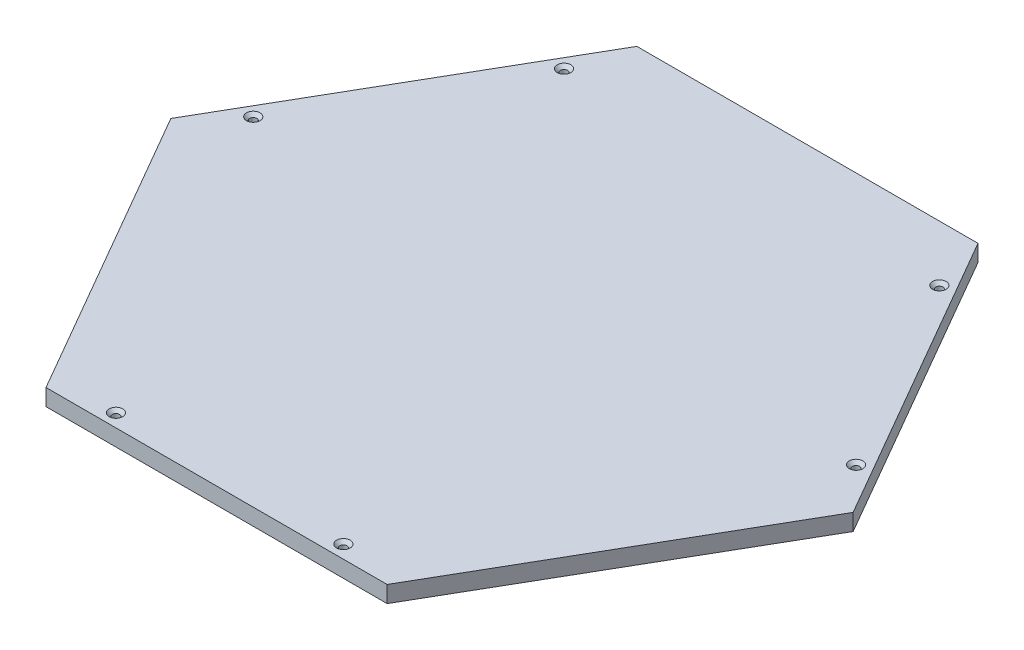
ISO-10303-21;
HEADER;
FILE_DESCRIPTION(('STEP AP214'),'2;1');
FILE_NAME('part.step','',(''),(''),'','','');
FILE_SCHEMA(('AUTOMOTIVE_DESIGN { 1 0 10303 214 1 1 1 1 }'));
ENDSEC;
DATA;
#1=APPLICATION_CONTEXT('core data for automotive mechanical design processes');
#2=APPLICATION_PROTOCOL_DEFINITION('international standard','automotive_design',2000,#1);
#3=PRODUCT_CONTEXT('',#1,'mechanical');
#4=PRODUCT('Part','Part','',(#3));
#5=PRODUCT_RELATED_PRODUCT_CATEGORY('part','',(#4));
#6=PRODUCT_DEFINITION_FORMATION('','',#4);
#7=PRODUCT_DEFINITION_CONTEXT('part definition',#1,'design');
#8=PRODUCT_DEFINITION('design','',#6,#7);
#9=PRODUCT_DEFINITION_SHAPE('','',#8);
#10=(LENGTH_UNIT() NAMED_UNIT(*) SI_UNIT(.MILLI.,.METRE.));
#11=(NAMED_UNIT(*) PLANE_ANGLE_UNIT() SI_UNIT($,.RADIAN.));
#12=(NAMED_UNIT(*) SI_UNIT($,.STERADIAN.) SOLID_ANGLE_UNIT());
#13=UNCERTAINTY_MEASURE_WITH_UNIT(LENGTH_MEASURE(1.E-05),#10,'distance_accuracy_value','');
#14=(GEOMETRIC_REPRESENTATION_CONTEXT(3) GLOBAL_UNCERTAINTY_ASSIGNED_CONTEXT((#13)) GLOBAL_UNIT_ASSIGNED_CONTEXT((#10,
#11,#12)) REPRESENTATION_CONTEXT('',''));
#15=CARTESIAN_POINT('',(0.,0.,0.));
#16=DIRECTION('',(0.,0.,1.));
#17=DIRECTION('',(1.,0.,0.));
#18=AXIS2_PLACEMENT_3D('',#15,#16,#17);
#19=CARTESIAN_POINT('',(966.247715506251,497.013360873487,2029.32960946755));
#20=DIRECTION('',(-0.866025403784439,0.,-0.5));
#21=DIRECTION('',(-0.5,0.,0.866025403784439));
#22=AXIS2_PLACEMENT_3D('',#19,#20,#21);
#23=PLANE('',#22);
#24=DIRECTION('',(0.5,0.,-0.866025403784438));
#25=VECTOR('',#24,1.);
#26=CARTESIAN_POINT('',(966.247715506251,484.313360873487,2029.32960946755));
#27=LINE('',#26,#25);
#28=CARTESIAN_POINT('',(966.247715506251,484.313360873487,2029.32960946755));
#29=VERTEX_POINT('',#28);
#30=CARTESIAN_POINT('',(1096.72341301647,484.313360873487,1803.33907222687));
#31=VERTEX_POINT('',#30);
#32=EDGE_CURVE('E120',#29,#31,#27,.T.);
#33=ORIENTED_EDGE('',*,*,#32,.T.);
#34=DIRECTION('',(0.,-1.,0.));
#35=VECTOR('',#34,1.);
#36=CARTESIAN_POINT('',(1096.72341301647,497.013360873487,1803.33907222687));
#37=LINE('',#36,#35);
#38=CARTESIAN_POINT('',(1096.72341301647,497.013360873487,1803.33907222687));
#39=VERTEX_POINT('',#38);
#40=EDGE_CURVE('E11',#39,#31,#37,.T.);
#41=ORIENTED_EDGE('',*,*,#40,.F.);
#42=DIRECTION('',(0.5,0.,-0.866025403784438));
#43=VECTOR('',#42,1.);
#44=CARTESIAN_POINT('',(966.247715506251,497.013360873487,2029.32960946755));
#45=LINE('',#44,#43);
#46=CARTESIAN_POINT('',(966.247715506251,497.013360873487,2029.32960946755));
#47=VERTEX_POINT('',#46);
#48=EDGE_CURVE('E131',#47,#39,#45,.T.);
#49=ORIENTED_EDGE('',*,*,#48,.F.);
#50=DIRECTION('',(0.,-1.,0.));
#51=VECTOR('',#50,1.);
#52=CARTESIAN_POINT('',(966.247715506251,497.013360873487,2029.32960946755));
#53=LINE('',#52,#51);
#54=EDGE_CURVE('E116',#47,#29,#53,.T.);
#55=ORIENTED_EDGE('',*,*,#54,.T.);
#56=EDGE_LOOP('',(#33,#41,#49,#55));
#57=FACE_BOUND('',#56,.T.);
#58=ADVANCED_FACE('F36',(#57),#23,.F.);
#59=CARTESIAN_POINT('',(1096.72341301647,497.013360873487,1803.33907222687));
#60=DIRECTION('',(-0.866025403784439,0.,0.5));
#61=DIRECTION('',(0.5,0.,0.866025403784439));
#62=AXIS2_PLACEMENT_3D('',#59,#60,#61);
#63=PLANE('',#62);
#64=DIRECTION('',(-0.5,0.,-0.866025403784438));
#65=VECTOR('',#64,1.);
#66=CARTESIAN_POINT('',(1096.72341301647,484.313360873487,1803.33907222687));
#67=LINE('',#66,#65);
#68=CARTESIAN_POINT('',(966.247715506251,484.313360873487,1577.34853498619));
#69=VERTEX_POINT('',#68);
#70=EDGE_CURVE('E123',#31,#69,#67,.T.);
#71=ORIENTED_EDGE('',*,*,#70,.T.);
#72=DIRECTION('',(0.,-1.,0.));
#73=VECTOR('',#72,1.);
#74=CARTESIAN_POINT('',(966.247715506251,497.013360873487,1577.34853498619));
#75=LINE('',#74,#73);
#76=CARTESIAN_POINT('',(966.247715506251,497.013360873487,1577.34853498619));
#77=VERTEX_POINT('',#76);
#78=EDGE_CURVE('E44',#77,#69,#75,.T.);
#79=ORIENTED_EDGE('',*,*,#78,.F.);
#80=DIRECTION('',(-0.5,0.,-0.866025403784438));
#81=VECTOR('',#80,1.);
#82=CARTESIAN_POINT('',(1096.72341301647,497.013360873487,1803.33907222687));
#83=LINE('',#82,#81);
#84=EDGE_CURVE('E89',#39,#77,#83,.T.);
#85=ORIENTED_EDGE('',*,*,#84,.F.);
#86=ORIENTED_EDGE('',*,*,#40,.T.);
#87=EDGE_LOOP('',(#71,#79,#85,#86));
#88=FACE_BOUND('',#87,.T.);
#89=ADVANCED_FACE('F156',(#88),#63,.F.);
#90=CARTESIAN_POINT('',(966.247715506251,497.013360873487,1577.34853498619));
#91=DIRECTION('',(0.,0.,1.));
#92=DIRECTION('',(1.,0.,0.));
#93=AXIS2_PLACEMENT_3D('',#90,#91,#92);
#94=PLANE('',#93);
#95=DIRECTION('',(-1.,0.,0.));
#96=VECTOR('',#95,1.);
#97=CARTESIAN_POINT('',(966.247715506251,484.313360873487,1577.34853498619));
#98=LINE('',#97,#96);
#99=CARTESIAN_POINT('',(705.296320485819,484.313360873487,1577.34853498619));
#100=VERTEX_POINT('',#99);
#101=EDGE_CURVE('E126',#69,#100,#98,.T.);
#102=ORIENTED_EDGE('',*,*,#101,.T.);
#103=DIRECTION('',(0.,-1.,0.));
#104=VECTOR('',#103,1.);
#105=CARTESIAN_POINT('',(705.296320485819,497.013360873487,1577.34853498619));
#106=LINE('',#105,#104);
#107=CARTESIAN_POINT('',(705.296320485819,497.013360873487,1577.34853498619));
#108=VERTEX_POINT('',#107);
#109=EDGE_CURVE('E111',#108,#100,#106,.T.);
#110=ORIENTED_EDGE('',*,*,#109,.F.);
#111=DIRECTION('',(-1.,0.,0.));
#112=VECTOR('',#111,1.);
#113=CARTESIAN_POINT('',(966.247715506251,497.013360873487,1577.34853498619));
#114=LINE('',#113,#112);
#115=EDGE_CURVE('E102',#77,#108,#114,.T.);
#116=ORIENTED_EDGE('',*,*,#115,.F.);
#117=ORIENTED_EDGE('',*,*,#78,.T.);
#118=EDGE_LOOP('',(#102,#110,#116,#117));
#119=FACE_BOUND('',#118,.T.);
#120=ADVANCED_FACE('F137',(#119),#94,.F.);
#121=CARTESIAN_POINT('',(705.296320485819,497.013360873487,1577.34853498619));
#122=DIRECTION('',(0.866025403784439,0.,0.5));
#123=DIRECTION('',(0.5,0.,-0.866025403784439));
#124=AXIS2_PLACEMENT_3D('',#121,#122,#123);
#125=PLANE('',#124);
#126=DIRECTION('',(-0.5,0.,0.866025403784439));
#127=VECTOR('',#126,1.);
#128=CARTESIAN_POINT('',(705.296320485819,484.313360873487,1577.34853498619));
#129=LINE('',#128,#127);
#130=CARTESIAN_POINT('',(574.820622975603,484.313360873487,1803.33907222687));
#131=VERTEX_POINT('',#130);
#132=EDGE_CURVE('E110',#100,#131,#129,.T.);
#133=ORIENTED_EDGE('',*,*,#132,.T.);
#134=DIRECTION('',(0.,-1.,0.));
#135=VECTOR('',#134,1.);
#136=CARTESIAN_POINT('',(574.820622975603,497.013360873487,1803.33907222687));
#137=LINE('',#136,#135);
#138=CARTESIAN_POINT('',(574.820622975603,497.013360873487,1803.33907222687));
#139=VERTEX_POINT('',#138);
#140=EDGE_CURVE('E107',#139,#131,#137,.T.);
#141=ORIENTED_EDGE('',*,*,#140,.F.);
#142=DIRECTION('',(-0.5,0.,0.866025403784439));
#143=VECTOR('',#142,1.);
#144=CARTESIAN_POINT('',(705.296320485819,497.013360873487,1577.34853498619));
#145=LINE('',#144,#143);
#146=EDGE_CURVE('E96',#108,#139,#145,.T.);
#147=ORIENTED_EDGE('',*,*,#146,.F.);
#148=ORIENTED_EDGE('',*,*,#109,.T.);
#149=EDGE_LOOP('',(#133,#141,#147,#148));
#150=FACE_BOUND('',#149,.T.);
#151=ADVANCED_FACE('F108',(#150),#125,.F.);
#152=CARTESIAN_POINT('',(574.820622975603,497.013360873487,1803.33907222687));
#153=DIRECTION('',(0.866025403784439,0.,-0.5));
#154=DIRECTION('',(-0.5,0.,-0.866025403784439));
#155=AXIS2_PLACEMENT_3D('',#152,#153,#154);
#156=PLANE('',#155);
#157=DIRECTION('',(0.5,0.,0.866025403784439));
#158=VECTOR('',#157,1.);
#159=CARTESIAN_POINT('',(574.820622975603,484.313360873487,1803.33907222687));
#160=LINE('',#159,#158);
#161=CARTESIAN_POINT('',(705.296320485819,484.313360873487,2029.32960946755));
#162=VERTEX_POINT('',#161);
#163=EDGE_CURVE('E75',#131,#162,#160,.T.);
#164=ORIENTED_EDGE('',*,*,#163,.T.);
#165=DIRECTION('',(0.,-1.,0.));
#166=VECTOR('',#165,1.);
#167=CARTESIAN_POINT('',(705.296320485819,497.013360873487,2029.32960946755));
#168=LINE('',#167,#166);
#169=CARTESIAN_POINT('',(705.296320485819,497.013360873487,2029.32960946755));
#170=VERTEX_POINT('',#169);
#171=EDGE_CURVE('E112',#170,#162,#168,.T.);
#172=ORIENTED_EDGE('',*,*,#171,.F.);
#173=DIRECTION('',(0.5,0.,0.866025403784439));
#174=VECTOR('',#173,1.);
#175=CARTESIAN_POINT('',(574.820622975603,497.013360873487,1803.33907222687));
#176=LINE('',#175,#174);
#177=EDGE_CURVE('E100',#139,#170,#176,.T.);
#178=ORIENTED_EDGE('',*,*,#177,.F.);
#179=ORIENTED_EDGE('',*,*,#140,.T.);
#180=EDGE_LOOP('',(#164,#172,#178,#179));
#181=FACE_BOUND('',#180,.T.);
#182=ADVANCED_FACE('F114',(#181),#156,.F.);
#183=CARTESIAN_POINT('',(705.296320485819,497.013360873487,2029.32960946755));
#184=DIRECTION('',(0.,0.,-1.));
#185=DIRECTION('',(-1.,0.,0.));
#186=AXIS2_PLACEMENT_3D('',#183,#184,#185);
#187=PLANE('',#186);
#188=DIRECTION('',(1.,0.,0.));
#189=VECTOR('',#188,1.);
#190=CARTESIAN_POINT('',(705.296320485819,484.313360873487,2029.32960946755));
#191=LINE('',#190,#189);
#192=EDGE_CURVE('E81',#162,#29,#191,.T.);
#193=ORIENTED_EDGE('',*,*,#192,.T.);
#194=ORIENTED_EDGE('',*,*,#54,.F.);
#195=DIRECTION('',(1.,0.,0.));
#196=VECTOR('',#195,1.);
#197=CARTESIAN_POINT('',(705.296320485819,497.013360873487,2029.32960946755));
#198=LINE('',#197,#196);
#199=EDGE_CURVE('E52',#170,#47,#198,.T.);
#200=ORIENTED_EDGE('',*,*,#199,.F.);
#201=ORIENTED_EDGE('',*,*,#171,.T.);
#202=EDGE_LOOP('',(#193,#194,#200,#201));
#203=FACE_BOUND('',#202,.T.);
#204=ADVANCED_FACE('F144',(#203),#187,.F.);
#205=CARTESIAN_POINT('',(0.,497.013360873487,0.));
#206=DIRECTION('',(0.,1.,0.));
#207=DIRECTION('',(0.,0.,1.));
#208=AXIS2_PLACEMENT_3D('',#205,#206,#207);
#209=PLANE('',#208);
#210=CARTESIAN_POINT('',(605.218725768555,497.013360873487,1770.68801373577));
#211=DIRECTION('',(0.,1.,0.));
#212=DIRECTION('',(0.,0.,1.));
#213=AXIS2_PLACEMENT_3D('',#210,#211,#212);
#214=CIRCLE('',#213,5.19999999999998);
#215=CARTESIAN_POINT('',(605.218725768555,497.013360873487,1775.88801373577));
#216=VERTEX_POINT('',#215);
#217=EDGE_CURVE('E322',#216,#216,#214,.T.);
#218=ORIENTED_EDGE('',*,*,#217,.F.);
#219=EDGE_LOOP('',(#218));
#220=FACE_BOUND('',#219,.T.);
#221=CARTESIAN_POINT('',(692.218725768555,497.013360873487,1619.99959347728));
#222=DIRECTION('',(0.,1.,0.));
#223=DIRECTION('',(0.,0.,1.));
#224=AXIS2_PLACEMENT_3D('',#221,#222,#223);
#225=CIRCLE('',#224,5.19999999999998);
#226=CARTESIAN_POINT('',(692.218725768555,497.013360873487,1625.19959347728));
#227=VERTEX_POINT('',#226);
#228=EDGE_CURVE('E329',#227,#227,#225,.T.);
#229=ORIENTED_EDGE('',*,*,#228,.F.);
#230=EDGE_LOOP('',(#229));
#231=FACE_BOUND('',#230,.T.);
#232=CARTESIAN_POINT('',(979.325310223515,497.013360873487,1619.99959347728));
#233=DIRECTION('',(0.,1.,0.));
#234=DIRECTION('',(0.,0.,1.));
#235=AXIS2_PLACEMENT_3D('',#232,#233,#234);
#236=CIRCLE('',#235,5.19999999999998);
#237=CARTESIAN_POINT('',(979.325310223515,497.013360873487,1625.19959347728));
#238=VERTEX_POINT('',#237);
#239=EDGE_CURVE('E338',#238,#238,#236,.T.);
#240=ORIENTED_EDGE('',*,*,#239,.F.);
#241=EDGE_LOOP('',(#240));
#242=FACE_BOUND('',#241,.T.);
#243=CARTESIAN_POINT('',(1066.32531022351,497.013360873487,1770.68801373577));
#244=DIRECTION('',(0.,1.,0.));
#245=DIRECTION('',(0.,0.,1.));
#246=AXIS2_PLACEMENT_3D('',#243,#244,#245);
#247=CIRCLE('',#246,5.20000000000009);
#248=CARTESIAN_POINT('',(1066.32531022351,497.013360873487,1775.88801373577));
#249=VERTEX_POINT('',#248);
#250=EDGE_CURVE('E347',#249,#249,#247,.T.);
#251=ORIENTED_EDGE('',*,*,#250,.F.);
#252=EDGE_LOOP('',(#251));
#253=FACE_BOUND('',#252,.T.);
#254=CARTESIAN_POINT('',(748.777572280273,497.013360873487,2019.32374649387));
#255=DIRECTION('',(0.,1.,0.));
#256=DIRECTION('',(0.,0.,1.));
#257=AXIS2_PLACEMENT_3D('',#254,#255,#256);
#258=CIRCLE('',#257,5.19999999999998);
#259=CARTESIAN_POINT('',(748.777572280273,497.013360873487,2024.52374649387));
#260=VERTEX_POINT('',#259);
#261=EDGE_CURVE('E356',#260,#260,#258,.T.);
#262=ORIENTED_EDGE('',*,*,#261,.F.);
#263=EDGE_LOOP('',(#262));
#264=FACE_BOUND('',#263,.T.);
#265=CARTESIAN_POINT('',(922.777572027246,497.013360873487,2019.31436283016));
#266=DIRECTION('',(0.,1.,0.));
#267=DIRECTION('',(0.,0.,1.));
#268=AXIS2_PLACEMENT_3D('',#265,#266,#267);
#269=CIRCLE('',#268,5.19999999999998);
#270=CARTESIAN_POINT('',(922.777572027246,497.013360873487,2024.51436283016));
#271=VERTEX_POINT('',#270);
#272=EDGE_CURVE('E365',#271,#271,#269,.T.);
#273=ORIENTED_EDGE('',*,*,#272,.F.);
#274=EDGE_LOOP('',(#273));
#275=FACE_BOUND('',#274,.T.);
#276=ORIENTED_EDGE('',*,*,#48,.T.);
#277=ORIENTED_EDGE('',*,*,#84,.T.);
#278=ORIENTED_EDGE('',*,*,#115,.T.);
#279=ORIENTED_EDGE('',*,*,#146,.T.);
#280=ORIENTED_EDGE('',*,*,#177,.T.);
#281=ORIENTED_EDGE('',*,*,#199,.T.);
#282=EDGE_LOOP('',(#276,#277,#278,#279,#280,#281));
#283=FACE_BOUND('',#282,.T.);
#284=ADVANCED_FACE('F98',(#220,#231,#242,#253,#264,#275,#283),#209,.T.);
#285=CARTESIAN_POINT('',(0.,484.313360873487,0.));
#286=DIRECTION('',(0.,1.,0.));
#287=DIRECTION('',(0.,0.,1.));
#288=AXIS2_PLACEMENT_3D('',#285,#286,#287);
#289=PLANE('',#288);
#290=CARTESIAN_POINT('',(605.218725768555,484.313360873487,1770.68801373577));
#291=DIRECTION('',(0.,1.,0.));
#292=DIRECTION('',(0.,0.,1.));
#293=AXIS2_PLACEMENT_3D('',#290,#291,#292);
#294=CIRCLE('',#293,2.75000000000003);
#295=CARTESIAN_POINT('',(605.218725768555,484.313360873487,1773.43801373577));
#296=VERTEX_POINT('',#295);
#297=EDGE_CURVE('E324',#296,#296,#294,.T.);
#298=ORIENTED_EDGE('',*,*,#297,.T.);
#299=EDGE_LOOP('',(#298));
#300=FACE_BOUND('',#299,.T.);
#301=CARTESIAN_POINT('',(692.218725768555,484.313360873487,1619.99959347728));
#302=DIRECTION('',(0.,1.,0.));
#303=DIRECTION('',(0.,0.,1.));
#304=AXIS2_PLACEMENT_3D('',#301,#302,#303);
#305=CIRCLE('',#304,2.75000000000003);
#306=CARTESIAN_POINT('',(692.218725768555,484.313360873487,1622.74959347728));
#307=VERTEX_POINT('',#306);
#308=EDGE_CURVE('E335',#307,#307,#305,.T.);
#309=ORIENTED_EDGE('',*,*,#308,.T.);
#310=EDGE_LOOP('',(#309));
#311=FACE_BOUND('',#310,.T.);
#312=CARTESIAN_POINT('',(979.325310223515,484.313360873487,1619.99959347728));
#313=DIRECTION('',(0.,1.,0.));
#314=DIRECTION('',(0.,0.,1.));
#315=AXIS2_PLACEMENT_3D('',#312,#313,#314);
#316=CIRCLE('',#315,2.75000000000003);
#317=CARTESIAN_POINT('',(979.325310223515,484.313360873487,1622.74959347728));
#318=VERTEX_POINT('',#317);
#319=EDGE_CURVE('E344',#318,#318,#316,.T.);
#320=ORIENTED_EDGE('',*,*,#319,.T.);
#321=EDGE_LOOP('',(#320));
#322=FACE_BOUND('',#321,.T.);
#323=CARTESIAN_POINT('',(1066.32531022351,484.313360873487,1770.68801373577));
#324=DIRECTION('',(0.,1.,0.));
#325=DIRECTION('',(0.,0.,1.));
#326=AXIS2_PLACEMENT_3D('',#323,#324,#325);
#327=CIRCLE('',#326,2.75000000000003);
#328=CARTESIAN_POINT('',(1066.32531022351,484.313360873487,1773.43801373577));
#329=VERTEX_POINT('',#328);
#330=EDGE_CURVE('E353',#329,#329,#327,.T.);
#331=ORIENTED_EDGE('',*,*,#330,.T.);
#332=EDGE_LOOP('',(#331));
#333=FACE_BOUND('',#332,.T.);
#334=CARTESIAN_POINT('',(748.777572280273,484.313360873487,2019.32374649387));
#335=DIRECTION('',(0.,1.,0.));
#336=DIRECTION('',(0.,0.,1.));
#337=AXIS2_PLACEMENT_3D('',#334,#335,#336);
#338=CIRCLE('',#337,2.75000000000003);
#339=CARTESIAN_POINT('',(748.777572280273,484.313360873487,2022.07374649387));
#340=VERTEX_POINT('',#339);
#341=EDGE_CURVE('E362',#340,#340,#338,.T.);
#342=ORIENTED_EDGE('',*,*,#341,.T.);
#343=EDGE_LOOP('',(#342));
#344=FACE_BOUND('',#343,.T.);
#345=CARTESIAN_POINT('',(922.777572027246,484.313360873487,2019.31436283016));
#346=DIRECTION('',(0.,1.,0.));
#347=DIRECTION('',(0.,0.,1.));
#348=AXIS2_PLACEMENT_3D('',#345,#346,#347);
#349=CIRCLE('',#348,2.75000000000003);
#350=CARTESIAN_POINT('',(922.777572027246,484.313360873487,2022.06436283016));
#351=VERTEX_POINT('',#350);
#352=EDGE_CURVE('E124',#351,#351,#349,.T.);
#353=ORIENTED_EDGE('',*,*,#352,.T.);
#354=EDGE_LOOP('',(#353));
#355=FACE_BOUND('',#354,.T.);
#356=ORIENTED_EDGE('',*,*,#32,.F.);
#357=ORIENTED_EDGE('',*,*,#192,.F.);
#358=ORIENTED_EDGE('',*,*,#163,.F.);
#359=ORIENTED_EDGE('',*,*,#132,.F.);
#360=ORIENTED_EDGE('',*,*,#101,.F.);
#361=ORIENTED_EDGE('',*,*,#70,.F.);
#362=EDGE_LOOP('',(#356,#357,#358,#359,#360,#361));
#363=FACE_BOUND('',#362,.T.);
#364=ADVANCED_FACE('F140',(#300,#311,#322,#333,#344,#355,#363),#289,.F.);
#365=CARTESIAN_POINT('',(922.777572027246,497.013360873487,2019.31436283016));
#366=DIRECTION('',(0.,1.,0.));
#367=DIRECTION('',(0.,0.,1.));
#368=AXIS2_PLACEMENT_3D('',#365,#366,#367);
#369=CYLINDRICAL_SURFACE('',#368,2.75000000000003);
#370=ORIENTED_EDGE('',*,*,#352,.F.);
#371=EDGE_LOOP('',(#370));
#372=FACE_BOUND('',#371,.T.);
#373=CARTESIAN_POINT('',(922.777572027246,494.563360873487,2019.31436283016));
#374=DIRECTION('',(0.,1.,0.));
#375=DIRECTION('',(0.,0.,1.));
#376=AXIS2_PLACEMENT_3D('',#373,#374,#375);
#377=CIRCLE('',#376,2.75000000000003);
#378=CARTESIAN_POINT('',(922.777572027246,494.563360873487,2022.06436283016));
#379=VERTEX_POINT('',#378);
#380=EDGE_CURVE('E368',#379,#379,#377,.T.);
#381=ORIENTED_EDGE('',*,*,#380,.T.);
#382=EDGE_LOOP('',(#381));
#383=FACE_BOUND('',#382,.T.);
#384=ADVANCED_FACE('F193',(#372,#383),#369,.F.);
#385=CARTESIAN_POINT('',(922.777572027246,497.013360873487,2019.31436283016));
#386=DIRECTION('',(0.,1.,0.));
#387=DIRECTION('',(0.,0.,1.));
#388=AXIS2_PLACEMENT_3D('',#385,#386,#387);
#389=CONICAL_SURFACE('',#388,5.19999999999998,0.785398163397437);
#390=ORIENTED_EDGE('',*,*,#380,.F.);
#391=EDGE_LOOP('',(#390));
#392=FACE_BOUND('',#391,.T.);
#393=ORIENTED_EDGE('',*,*,#272,.T.);
#394=EDGE_LOOP('',(#393));
#395=FACE_BOUND('',#394,.T.);
#396=ADVANCED_FACE('F202',(#392,#395),#389,.F.);
#397=CARTESIAN_POINT('',(748.777572280273,497.013360873487,2019.32374649387));
#398=DIRECTION('',(0.,1.,0.));
#399=DIRECTION('',(0.,0.,1.));
#400=AXIS2_PLACEMENT_3D('',#397,#398,#399);
#401=CYLINDRICAL_SURFACE('',#400,2.75000000000003);
#402=ORIENTED_EDGE('',*,*,#341,.F.);
#403=EDGE_LOOP('',(#402));
#404=FACE_BOUND('',#403,.T.);
#405=CARTESIAN_POINT('',(748.777572280273,494.563360873487,2019.32374649387));
#406=DIRECTION('',(0.,1.,0.));
#407=DIRECTION('',(0.,0.,1.));
#408=AXIS2_PLACEMENT_3D('',#405,#406,#407);
#409=CIRCLE('',#408,2.75000000000003);
#410=CARTESIAN_POINT('',(748.777572280273,494.563360873487,2022.07374649387));
#411=VERTEX_POINT('',#410);
#412=EDGE_CURVE('E359',#411,#411,#409,.T.);
#413=ORIENTED_EDGE('',*,*,#412,.T.);
#414=EDGE_LOOP('',(#413));
#415=FACE_BOUND('',#414,.T.);
#416=ADVANCED_FACE('F212',(#404,#415),#401,.F.);
#417=CARTESIAN_POINT('',(748.777572280273,497.013360873487,2019.32374649387));
#418=DIRECTION('',(0.,1.,0.));
#419=DIRECTION('',(0.,0.,1.));
#420=AXIS2_PLACEMENT_3D('',#417,#418,#419);
#421=CONICAL_SURFACE('',#420,5.19999999999998,0.785398163397437);
#422=ORIENTED_EDGE('',*,*,#412,.F.);
#423=EDGE_LOOP('',(#422));
#424=FACE_BOUND('',#423,.T.);
#425=ORIENTED_EDGE('',*,*,#261,.T.);
#426=EDGE_LOOP('',(#425));
#427=FACE_BOUND('',#426,.T.);
#428=ADVANCED_FACE('F222',(#424,#427),#421,.F.);
#429=CARTESIAN_POINT('',(1066.32531022351,497.013360873487,1770.68801373577));
#430=DIRECTION('',(0.,1.,0.));
#431=DIRECTION('',(0.,0.,1.));
#432=AXIS2_PLACEMENT_3D('',#429,#430,#431);
#433=CYLINDRICAL_SURFACE('',#432,2.75000000000003);
#434=ORIENTED_EDGE('',*,*,#330,.F.);
#435=EDGE_LOOP('',(#434));
#436=FACE_BOUND('',#435,.T.);
#437=CARTESIAN_POINT('',(1066.32531022351,494.563360873487,1770.68801373577));
#438=DIRECTION('',(0.,1.,0.));
#439=DIRECTION('',(0.,0.,1.));
#440=AXIS2_PLACEMENT_3D('',#437,#438,#439);
#441=CIRCLE('',#440,2.75000000000003);
#442=CARTESIAN_POINT('',(1066.32531022351,494.563360873487,1773.43801373577));
#443=VERTEX_POINT('',#442);
#444=EDGE_CURVE('E350',#443,#443,#441,.T.);
#445=ORIENTED_EDGE('',*,*,#444,.T.);
#446=EDGE_LOOP('',(#445));
#447=FACE_BOUND('',#446,.T.);
#448=ADVANCED_FACE('F232',(#436,#447),#433,.F.);
#449=CARTESIAN_POINT('',(1066.32531022351,497.013360873487,1770.68801373577));
#450=DIRECTION('',(0.,1.,0.));
#451=DIRECTION('',(0.,0.,1.));
#452=AXIS2_PLACEMENT_3D('',#449,#450,#451);
#453=CONICAL_SURFACE('',#452,5.20000000000009,0.78539816339746);
#454=ORIENTED_EDGE('',*,*,#444,.F.);
#455=EDGE_LOOP('',(#454));
#456=FACE_BOUND('',#455,.T.);
#457=ORIENTED_EDGE('',*,*,#250,.T.);
#458=EDGE_LOOP('',(#457));
#459=FACE_BOUND('',#458,.T.);
#460=ADVANCED_FACE('F242',(#456,#459),#453,.F.);
#461=CARTESIAN_POINT('',(979.325310223515,497.013360873487,1619.99959347728));
#462=DIRECTION('',(0.,1.,0.));
#463=DIRECTION('',(0.,0.,1.));
#464=AXIS2_PLACEMENT_3D('',#461,#462,#463);
#465=CYLINDRICAL_SURFACE('',#464,2.75000000000003);
#466=ORIENTED_EDGE('',*,*,#319,.F.);
#467=EDGE_LOOP('',(#466));
#468=FACE_BOUND('',#467,.T.);
#469=CARTESIAN_POINT('',(979.325310223515,494.563360873487,1619.99959347728));
#470=DIRECTION('',(0.,1.,0.));
#471=DIRECTION('',(0.,0.,1.));
#472=AXIS2_PLACEMENT_3D('',#469,#470,#471);
#473=CIRCLE('',#472,2.75000000000003);
#474=CARTESIAN_POINT('',(979.325310223515,494.563360873487,1622.74959347728));
#475=VERTEX_POINT('',#474);
#476=EDGE_CURVE('E341',#475,#475,#473,.T.);
#477=ORIENTED_EDGE('',*,*,#476,.T.);
#478=EDGE_LOOP('',(#477));
#479=FACE_BOUND('',#478,.T.);
#480=ADVANCED_FACE('F252',(#468,#479),#465,.F.);
#481=CARTESIAN_POINT('',(979.325310223515,497.013360873487,1619.99959347728));
#482=DIRECTION('',(0.,1.,0.));
#483=DIRECTION('',(0.,0.,1.));
#484=AXIS2_PLACEMENT_3D('',#481,#482,#483);
#485=CONICAL_SURFACE('',#484,5.19999999999998,0.785398163397437);
#486=ORIENTED_EDGE('',*,*,#476,.F.);
#487=EDGE_LOOP('',(#486));
#488=FACE_BOUND('',#487,.T.);
#489=ORIENTED_EDGE('',*,*,#239,.T.);
#490=EDGE_LOOP('',(#489));
#491=FACE_BOUND('',#490,.T.);
#492=ADVANCED_FACE('F262',(#488,#491),#485,.F.);
#493=CARTESIAN_POINT('',(692.218725768555,497.013360873487,1619.99959347728));
#494=DIRECTION('',(0.,1.,0.));
#495=DIRECTION('',(0.,0.,1.));
#496=AXIS2_PLACEMENT_3D('',#493,#494,#495);
#497=CYLINDRICAL_SURFACE('',#496,2.75000000000003);
#498=ORIENTED_EDGE('',*,*,#308,.F.);
#499=EDGE_LOOP('',(#498));
#500=FACE_BOUND('',#499,.T.);
#501=CARTESIAN_POINT('',(692.218725768555,494.563360873487,1619.99959347728));
#502=DIRECTION('',(0.,1.,0.));
#503=DIRECTION('',(0.,0.,1.));
#504=AXIS2_PLACEMENT_3D('',#501,#502,#503);
#505=CIRCLE('',#504,2.75000000000003);
#506=CARTESIAN_POINT('',(692.218725768555,494.563360873487,1622.74959347728));
#507=VERTEX_POINT('',#506);
#508=EDGE_CURVE('E332',#507,#507,#505,.T.);
#509=ORIENTED_EDGE('',*,*,#508,.T.);
#510=EDGE_LOOP('',(#509));
#511=FACE_BOUND('',#510,.T.);
#512=ADVANCED_FACE('F272',(#500,#511),#497,.F.);
#513=CARTESIAN_POINT('',(692.218725768555,497.013360873487,1619.99959347728));
#514=DIRECTION('',(0.,1.,0.));
#515=DIRECTION('',(0.,0.,1.));
#516=AXIS2_PLACEMENT_3D('',#513,#514,#515);
#517=CONICAL_SURFACE('',#516,5.19999999999998,0.785398163397437);
#518=ORIENTED_EDGE('',*,*,#508,.F.);
#519=EDGE_LOOP('',(#518));
#520=FACE_BOUND('',#519,.T.);
#521=ORIENTED_EDGE('',*,*,#228,.T.);
#522=EDGE_LOOP('',(#521));
#523=FACE_BOUND('',#522,.T.);
#524=ADVANCED_FACE('F282',(#520,#523),#517,.F.);
#525=CARTESIAN_POINT('',(605.218725768555,497.013360873487,1770.68801373577));
#526=DIRECTION('',(0.,1.,0.));
#527=DIRECTION('',(0.,0.,1.));
#528=AXIS2_PLACEMENT_3D('',#525,#526,#527);
#529=CYLINDRICAL_SURFACE('',#528,2.75000000000003);
#530=ORIENTED_EDGE('',*,*,#297,.F.);
#531=EDGE_LOOP('',(#530));
#532=FACE_BOUND('',#531,.T.);
#533=CARTESIAN_POINT('',(605.218725768555,494.563360873487,1770.68801373577));
#534=DIRECTION('',(0.,1.,0.));
#535=DIRECTION('',(0.,0.,1.));
#536=AXIS2_PLACEMENT_3D('',#533,#534,#535);
#537=CIRCLE('',#536,2.75000000000003);
#538=CARTESIAN_POINT('',(605.218725768555,494.563360873487,1773.43801373577));
#539=VERTEX_POINT('',#538);
#540=EDGE_CURVE('E319',#539,#539,#537,.T.);
#541=ORIENTED_EDGE('',*,*,#540,.T.);
#542=EDGE_LOOP('',(#541));
#543=FACE_BOUND('',#542,.T.);
#544=ADVANCED_FACE('F292',(#532,#543),#529,.F.);
#545=CARTESIAN_POINT('',(605.218725768555,497.013360873487,1770.68801373577));
#546=DIRECTION('',(0.,1.,0.));
#547=DIRECTION('',(0.,0.,1.));
#548=AXIS2_PLACEMENT_3D('',#545,#546,#547);
#549=CONICAL_SURFACE('',#548,5.19999999999998,0.785398163397437);
#550=ORIENTED_EDGE('',*,*,#540,.F.);
#551=EDGE_LOOP('',(#550));
#552=FACE_BOUND('',#551,.T.);
#553=ORIENTED_EDGE('',*,*,#217,.T.);
#554=EDGE_LOOP('',(#553));
#555=FACE_BOUND('',#554,.T.);
#556=ADVANCED_FACE('F302',(#552,#555),#549,.F.);
#557=CLOSED_SHELL('',(#58,#89,#120,#151,#182,#204,#284,#364,#384,#396,#416,#428,#448,#460,#480,
#492,#512,#524,#544,#556));
#558=MANIFOLD_SOLID_BREP('B2',#557);
#559=ADVANCED_BREP_SHAPE_REPRESENTATION('',(#18,#558),#14);
#560=SHAPE_DEFINITION_REPRESENTATION(#9,#559);
ENDSEC;
END-ISO-10303-21;
